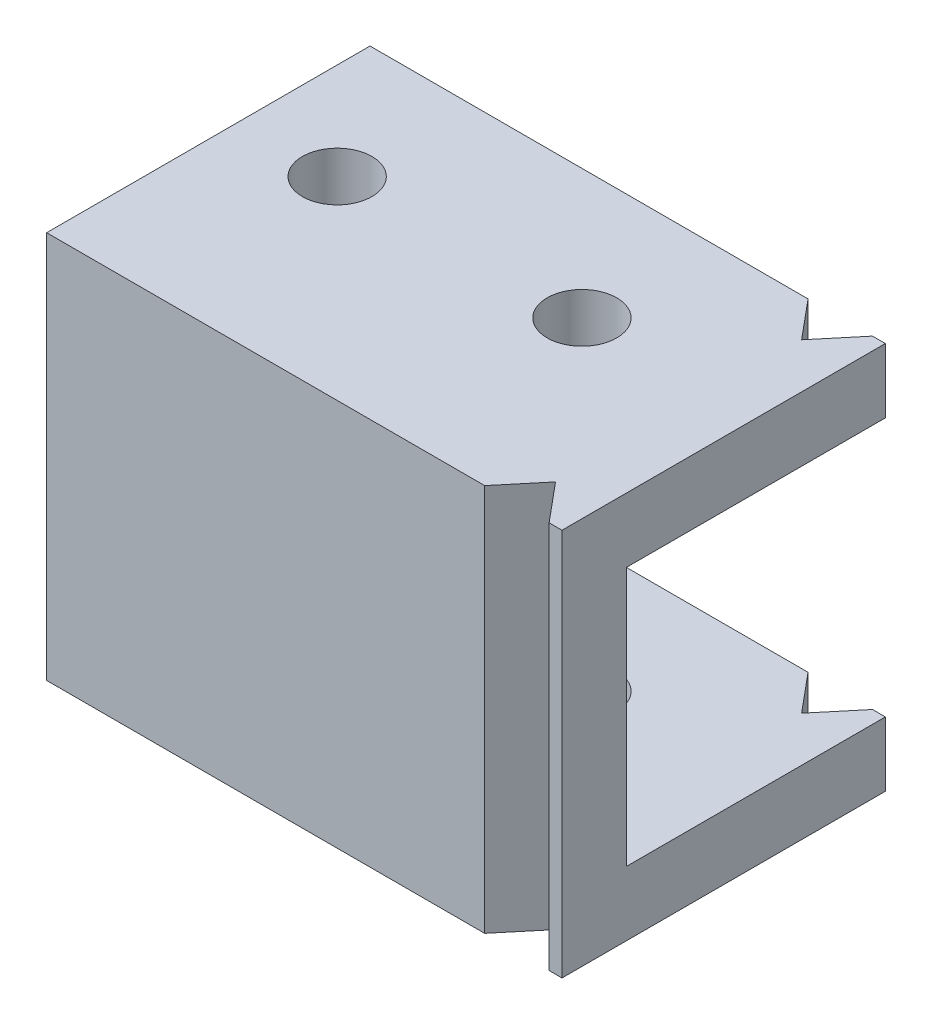
ISO-10303-21;
HEADER;
FILE_DESCRIPTION(('STEP AP214'),'2;1');
FILE_NAME('part.step','',(''),(''),'','','');
FILE_SCHEMA(('AUTOMOTIVE_DESIGN { 1 0 10303 214 1 1 1 1 }'));
ENDSEC;
DATA;
#1=APPLICATION_CONTEXT('core data for automotive mechanical design processes');
#2=APPLICATION_PROTOCOL_DEFINITION('international standard','automotive_design',2000,#1);
#3=PRODUCT_CONTEXT('',#1,'mechanical');
#4=PRODUCT('Part','Part','',(#3));
#5=PRODUCT_RELATED_PRODUCT_CATEGORY('part','',(#4));
#6=PRODUCT_DEFINITION_FORMATION('','',#4);
#7=PRODUCT_DEFINITION_CONTEXT('part definition',#1,'design');
#8=PRODUCT_DEFINITION('design','',#6,#7);
#9=PRODUCT_DEFINITION_SHAPE('','',#8);
#10=(LENGTH_UNIT() NAMED_UNIT(*) SI_UNIT(.MILLI.,.METRE.));
#11=(NAMED_UNIT(*) PLANE_ANGLE_UNIT() SI_UNIT($,.RADIAN.));
#12=(NAMED_UNIT(*) SI_UNIT($,.STERADIAN.) SOLID_ANGLE_UNIT());
#13=UNCERTAINTY_MEASURE_WITH_UNIT(LENGTH_MEASURE(1.E-05),#10,'distance_accuracy_value','');
#14=(GEOMETRIC_REPRESENTATION_CONTEXT(3) GLOBAL_UNCERTAINTY_ASSIGNED_CONTEXT((#13)) GLOBAL_UNIT_ASSIGNED_CONTEXT((#10,
#11,#12)) REPRESENTATION_CONTEXT('',''));
#15=CARTESIAN_POINT('',(0.,0.,0.));
#16=DIRECTION('',(0.,0.,1.));
#17=DIRECTION('',(1.,0.,0.));
#18=AXIS2_PLACEMENT_3D('',#15,#16,#17);
#19=CARTESIAN_POINT('',(40.,15.05,-10.05));
#20=DIRECTION('',(0.,0.,1.));
#21=DIRECTION('',(1.,0.,0.));
#22=AXIS2_PLACEMENT_3D('',#19,#20,#21);
#23=PLANE('',#22);
#24=DIRECTION('',(-1.,0.,0.));
#25=VECTOR('',#24,1.);
#26=CARTESIAN_POINT('',(40.,10.05,-10.05));
#27=LINE('',#26,#25);
#28=CARTESIAN_POINT('',(40.,10.05,-10.05));
#29=VERTEX_POINT('',#28);
#30=CARTESIAN_POINT('',(39.,10.05,-10.05));
#31=VERTEX_POINT('',#30);
#32=EDGE_CURVE('E204',#29,#31,#27,.T.);
#33=ORIENTED_EDGE('',*,*,#32,.T.);
#34=DIRECTION('',(0.,1.,0.));
#35=VECTOR('',#34,1.);
#36=CARTESIAN_POINT('',(39.,-15.05,-10.05));
#37=LINE('',#36,#35);
#38=CARTESIAN_POINT('',(39.,15.05,-10.05));
#39=VERTEX_POINT('',#38);
#40=EDGE_CURVE('E295',#31,#39,#37,.T.);
#41=ORIENTED_EDGE('',*,*,#40,.T.);
#42=DIRECTION('',(-1.,0.,0.));
#43=VECTOR('',#42,1.);
#44=CARTESIAN_POINT('',(40.,15.05,-10.05));
#45=LINE('',#44,#43);
#46=CARTESIAN_POINT('',(40.,15.05,-10.05));
#47=VERTEX_POINT('',#46);
#48=EDGE_CURVE('E200',#47,#39,#45,.T.);
#49=ORIENTED_EDGE('',*,*,#48,.F.);
#50=DIRECTION('',(0.,1.,0.));
#51=VECTOR('',#50,1.);
#52=CARTESIAN_POINT('',(40.,15.05,-10.05));
#53=LINE('',#52,#51);
#54=EDGE_CURVE('E238',#29,#47,#53,.T.);
#55=ORIENTED_EDGE('',*,*,#54,.F.);
#56=EDGE_LOOP('',(#33,#41,#49,#55));
#57=FACE_BOUND('',#56,.T.);
#58=ADVANCED_FACE('F35',(#57),#23,.F.);
#59=CARTESIAN_POINT('',(40.,-15.05,15.05));
#60=DIRECTION('',(0.,0.,-1.));
#61=DIRECTION('',(-1.,0.,0.));
#62=AXIS2_PLACEMENT_3D('',#59,#60,#61);
#63=PLANE('',#62);
#64=DIRECTION('',(-1.,0.,0.));
#65=VECTOR('',#64,1.);
#66=CARTESIAN_POINT('',(40.,-15.05,15.05));
#67=LINE('',#66,#65);
#68=CARTESIAN_POINT('',(34.,-15.05,15.05));
#69=VERTEX_POINT('',#68);
#70=CARTESIAN_POINT('',(0.,-15.05,15.05));
#71=VERTEX_POINT('',#70);
#72=EDGE_CURVE('E187',#69,#71,#67,.T.);
#73=ORIENTED_EDGE('',*,*,#72,.F.);
#74=DIRECTION('',(0.,1.,0.));
#75=VECTOR('',#74,1.);
#76=CARTESIAN_POINT('',(34.,-15.05,15.05));
#77=LINE('',#76,#75);
#78=CARTESIAN_POINT('',(34.,15.05,15.05));
#79=VERTEX_POINT('',#78);
#80=EDGE_CURVE('E315',#69,#79,#77,.T.);
#81=ORIENTED_EDGE('',*,*,#80,.T.);
#82=DIRECTION('',(-1.,0.,0.));
#83=VECTOR('',#82,1.);
#84=CARTESIAN_POINT('',(40.,15.05,15.05));
#85=LINE('',#84,#83);
#86=CARTESIAN_POINT('',(0.,15.05,15.05));
#87=VERTEX_POINT('',#86);
#88=EDGE_CURVE('E195',#79,#87,#85,.T.);
#89=ORIENTED_EDGE('',*,*,#88,.T.);
#90=DIRECTION('',(0.,-1.,0.));
#91=VECTOR('',#90,1.);
#92=CARTESIAN_POINT('',(0.,-15.05,15.05));
#93=LINE('',#92,#91);
#94=EDGE_CURVE('E262',#87,#71,#93,.T.);
#95=ORIENTED_EDGE('',*,*,#94,.T.);
#96=EDGE_LOOP('',(#73,#81,#89,#95));
#97=FACE_BOUND('',#96,.T.);
#98=ADVANCED_FACE('F373',(#97),#63,.F.);
#99=CARTESIAN_POINT('',(40.,-10.05,-10.05));
#100=DIRECTION('',(0.,0.,1.));
#101=DIRECTION('',(0.,-1.,0.));
#102=AXIS2_PLACEMENT_3D('',#99,#100,#101);
#103=PLANE('',#102);
#104=DIRECTION('',(-1.,0.,0.));
#105=VECTOR('',#104,1.);
#106=CARTESIAN_POINT('',(40.,-15.05,-10.05));
#107=LINE('',#106,#105);
#108=CARTESIAN_POINT('',(40.,-15.05,-10.05));
#109=VERTEX_POINT('',#108);
#110=CARTESIAN_POINT('',(39.,-15.05,-10.05));
#111=VERTEX_POINT('',#110);
#112=EDGE_CURVE('E183',#109,#111,#107,.T.);
#113=ORIENTED_EDGE('',*,*,#112,.T.);
#114=CARTESIAN_POINT('',(39.,-10.05,-10.05));
#115=VERTEX_POINT('',#114);
#116=EDGE_CURVE('E291',#111,#115,#37,.T.);
#117=ORIENTED_EDGE('',*,*,#116,.T.);
#118=DIRECTION('',(-1.,0.,0.));
#119=VECTOR('',#118,1.);
#120=CARTESIAN_POINT('',(40.,-10.05,-10.05));
#121=LINE('',#120,#119);
#122=CARTESIAN_POINT('',(40.,-10.05,-10.05));
#123=VERTEX_POINT('',#122);
#124=EDGE_CURVE('E184',#123,#115,#121,.T.);
#125=ORIENTED_EDGE('',*,*,#124,.F.);
#126=DIRECTION('',(0.,1.,0.));
#127=VECTOR('',#126,1.);
#128=CARTESIAN_POINT('',(40.,-10.05,-10.05));
#129=LINE('',#128,#127);
#130=EDGE_CURVE('E246',#109,#123,#129,.T.);
#131=ORIENTED_EDGE('',*,*,#130,.F.);
#132=EDGE_LOOP('',(#113,#117,#125,#131));
#133=FACE_BOUND('',#132,.T.);
#134=ADVANCED_FACE('F290',(#133),#103,.F.);
#135=CARTESIAN_POINT('',(40.,10.05,10.05));
#136=DIRECTION('',(0.,0.,1.));
#137=DIRECTION('',(0.,-1.,0.));
#138=AXIS2_PLACEMENT_3D('',#135,#136,#137);
#139=PLANE('',#138);
#140=DIRECTION('',(0.,1.,0.));
#141=VECTOR('',#140,1.);
#142=CARTESIAN_POINT('',(0.,10.05,10.05));
#143=LINE('',#142,#141);
#144=CARTESIAN_POINT('',(0.,-10.05,10.05));
#145=VERTEX_POINT('',#144);
#146=CARTESIAN_POINT('',(0.,10.05,10.05));
#147=VERTEX_POINT('',#146);
#148=EDGE_CURVE('E231',#145,#147,#143,.T.);
#149=ORIENTED_EDGE('',*,*,#148,.T.);
#150=DIRECTION('',(-1.,0.,0.));
#151=VECTOR('',#150,1.);
#152=CARTESIAN_POINT('',(40.,10.05,10.05));
#153=LINE('',#152,#151);
#154=CARTESIAN_POINT('',(40.,10.05,10.05));
#155=VERTEX_POINT('',#154);
#156=EDGE_CURVE('E207',#155,#147,#153,.T.);
#157=ORIENTED_EDGE('',*,*,#156,.F.);
#158=DIRECTION('',(0.,1.,0.));
#159=VECTOR('',#158,1.);
#160=CARTESIAN_POINT('',(40.,10.05,10.05));
#161=LINE('',#160,#159);
#162=CARTESIAN_POINT('',(40.,-10.05,10.05));
#163=VERTEX_POINT('',#162);
#164=EDGE_CURVE('E232',#163,#155,#161,.T.);
#165=ORIENTED_EDGE('',*,*,#164,.F.);
#166=DIRECTION('',(-1.,0.,0.));
#167=VECTOR('',#166,1.);
#168=CARTESIAN_POINT('',(40.,-10.05,10.05));
#169=LINE('',#168,#167);
#170=EDGE_CURVE('E250',#163,#145,#169,.T.);
#171=ORIENTED_EDGE('',*,*,#170,.T.);
#172=EDGE_LOOP('',(#149,#157,#165,#171));
#173=FACE_BOUND('',#172,.T.);
#174=ADVANCED_FACE('F37',(#173),#139,.F.);
#175=CARTESIAN_POINT('',(40.,10.05,-10.05));
#176=DIRECTION('',(0.,1.,0.));
#177=DIRECTION('',(0.,0.,1.));
#178=AXIS2_PLACEMENT_3D('',#175,#176,#177);
#179=PLANE('',#178);
#180=CARTESIAN_POINT('',(7.5,10.05,0.));
#181=DIRECTION('',(0.,1.,0.));
#182=DIRECTION('',(0.,0.,1.));
#183=AXIS2_PLACEMENT_3D('',#180,#181,#182);
#184=CIRCLE('',#183,2.7);
#185=CARTESIAN_POINT('',(7.5,10.05,2.7));
#186=VERTEX_POINT('',#185);
#187=EDGE_CURVE('E228',#186,#186,#184,.T.);
#188=ORIENTED_EDGE('',*,*,#187,.T.);
#189=EDGE_LOOP('',(#188));
#190=FACE_BOUND('',#189,.T.);
#191=CARTESIAN_POINT('',(26.5,10.05,0.));
#192=DIRECTION('',(0.,1.,0.));
#193=DIRECTION('',(0.,0.,1.));
#194=AXIS2_PLACEMENT_3D('',#191,#192,#193);
#195=CIRCLE('',#194,2.70000000000001);
#196=CARTESIAN_POINT('',(26.5,10.05,2.70000000000001));
#197=VERTEX_POINT('',#196);
#198=EDGE_CURVE('E212',#197,#197,#195,.T.);
#199=ORIENTED_EDGE('',*,*,#198,.T.);
#200=EDGE_LOOP('',(#199));
#201=FACE_BOUND('',#200,.T.);
#202=DIRECTION('',(0.64018439966448,0.,0.768221279597376));
#203=VECTOR('',#202,1.);
#204=CARTESIAN_POINT('',(36.4590163934426,10.05,-7.09918032786885));
#205=LINE('',#204,#203);
#206=CARTESIAN_POINT('',(34.,10.05,-10.05));
#207=VERTEX_POINT('',#206);
#208=CARTESIAN_POINT('',(36.5,10.05,-7.05));
#209=VERTEX_POINT('',#208);
#210=EDGE_CURVE('E219',#207,#209,#205,.T.);
#211=ORIENTED_EDGE('',*,*,#210,.T.);
#212=DIRECTION('',(0.640184399664479,0.,-0.768221279597377));
#213=VECTOR('',#212,1.);
#214=CARTESIAN_POINT('',(39.4098360655738,10.05,-10.5418032786885));
#215=LINE('',#214,#213);
#216=EDGE_CURVE('E213',#209,#31,#215,.T.);
#217=ORIENTED_EDGE('',*,*,#216,.T.);
#218=ORIENTED_EDGE('',*,*,#32,.F.);
#219=DIRECTION('',(0.,0.,-1.));
#220=VECTOR('',#219,1.);
#221=CARTESIAN_POINT('',(40.,10.05,-10.05));
#222=LINE('',#221,#220);
#223=EDGE_CURVE('E235',#155,#29,#222,.T.);
#224=ORIENTED_EDGE('',*,*,#223,.F.);
#225=ORIENTED_EDGE('',*,*,#156,.T.);
#226=DIRECTION('',(0.,0.,-1.));
#227=VECTOR('',#226,1.);
#228=CARTESIAN_POINT('',(0.,10.05,-10.05));
#229=LINE('',#228,#227);
#230=CARTESIAN_POINT('',(0.,10.05,-10.05));
#231=VERTEX_POINT('',#230);
#232=EDGE_CURVE('E253',#147,#231,#229,.T.);
#233=ORIENTED_EDGE('',*,*,#232,.T.);
#234=EDGE_CURVE('E203',#207,#231,#27,.T.);
#235=ORIENTED_EDGE('',*,*,#234,.F.);
#236=EDGE_LOOP('',(#211,#217,#218,#224,#225,#233,#235));
#237=FACE_BOUND('',#236,.T.);
#238=ADVANCED_FACE('F280',(#190,#201,#237),#179,.F.);
#239=CARTESIAN_POINT('',(34.,15.05,-10.05));
#240=VERTEX_POINT('',#239);
#241=CARTESIAN_POINT('',(0.,15.05,-10.05));
#242=VERTEX_POINT('',#241);
#243=EDGE_CURVE('E199',#240,#242,#45,.T.);
#244=ORIENTED_EDGE('',*,*,#243,.F.);
#245=DIRECTION('',(0.,1.,0.));
#246=VECTOR('',#245,1.);
#247=CARTESIAN_POINT('',(34.,-15.05,-10.05));
#248=LINE('',#247,#246);
#249=EDGE_CURVE('E52',#207,#240,#248,.T.);
#250=ORIENTED_EDGE('',*,*,#249,.F.);
#251=ORIENTED_EDGE('',*,*,#234,.T.);
#252=DIRECTION('',(0.,1.,0.));
#253=VECTOR('',#252,1.);
#254=CARTESIAN_POINT('',(0.,15.05,-10.05));
#255=LINE('',#254,#253);
#256=EDGE_CURVE('E256',#231,#242,#255,.T.);
#257=ORIENTED_EDGE('',*,*,#256,.T.);
#258=EDGE_LOOP('',(#244,#250,#251,#257));
#259=FACE_BOUND('',#258,.T.);
#260=ADVANCED_FACE('F375',(#259),#23,.F.);
#261=CARTESIAN_POINT('',(40.,15.05,15.05));
#262=DIRECTION('',(0.,-1.,0.));
#263=DIRECTION('',(0.,0.,-1.));
#264=AXIS2_PLACEMENT_3D('',#261,#262,#263);
#265=PLANE('',#264);
#266=CARTESIAN_POINT('',(7.5,15.05,0.));
#267=DIRECTION('',(0.,1.,0.));
#268=DIRECTION('',(0.,0.,1.));
#269=AXIS2_PLACEMENT_3D('',#266,#267,#268);
#270=CIRCLE('',#269,2.7);
#271=CARTESIAN_POINT('',(7.5,15.05,2.7));
#272=VERTEX_POINT('',#271);
#273=EDGE_CURVE('E345',#272,#272,#270,.T.);
#274=ORIENTED_EDGE('',*,*,#273,.F.);
#275=EDGE_LOOP('',(#274));
#276=FACE_BOUND('',#275,.T.);
#277=CARTESIAN_POINT('',(26.5,15.05,0.));
#278=DIRECTION('',(0.,1.,0.));
#279=DIRECTION('',(0.,0.,1.));
#280=AXIS2_PLACEMENT_3D('',#277,#278,#279);
#281=CIRCLE('',#280,2.70000000000001);
#282=CARTESIAN_POINT('',(26.5,15.05,2.70000000000001));
#283=VERTEX_POINT('',#282);
#284=EDGE_CURVE('E294',#283,#283,#281,.T.);
#285=ORIENTED_EDGE('',*,*,#284,.F.);
#286=EDGE_LOOP('',(#285));
#287=FACE_BOUND('',#286,.T.);
#288=ORIENTED_EDGE('',*,*,#48,.T.);
#289=DIRECTION('',(0.640184399664479,0.,-0.768221279597377));
#290=VECTOR('',#289,1.);
#291=CARTESIAN_POINT('',(36.5,15.05,-7.05));
#292=LINE('',#291,#290);
#293=CARTESIAN_POINT('',(36.5,15.05,-7.05));
#294=VERTEX_POINT('',#293);
#295=EDGE_CURVE('E168',#294,#39,#292,.T.);
#296=ORIENTED_EDGE('',*,*,#295,.F.);
#297=DIRECTION('',(0.64018439966448,0.,0.768221279597375));
#298=VECTOR('',#297,1.);
#299=CARTESIAN_POINT('',(34.,15.05,-10.05));
#300=LINE('',#299,#298);
#301=EDGE_CURVE('E318',#240,#294,#300,.T.);
#302=ORIENTED_EDGE('',*,*,#301,.F.);
#303=ORIENTED_EDGE('',*,*,#243,.T.);
#304=DIRECTION('',(0.,0.,1.));
#305=VECTOR('',#304,1.);
#306=CARTESIAN_POINT('',(0.,15.05,15.05));
#307=LINE('',#306,#305);
#308=EDGE_CURVE('E259',#242,#87,#307,.T.);
#309=ORIENTED_EDGE('',*,*,#308,.T.);
#310=ORIENTED_EDGE('',*,*,#88,.F.);
#311=DIRECTION('',(-0.64018439966448,0.,0.768221279597375));
#312=VECTOR('',#311,1.);
#313=CARTESIAN_POINT('',(34.,15.05,15.05));
#314=LINE('',#313,#312);
#315=CARTESIAN_POINT('',(36.5,15.05,12.05));
#316=VERTEX_POINT('',#315);
#317=EDGE_CURVE('E308',#316,#79,#314,.T.);
#318=ORIENTED_EDGE('',*,*,#317,.F.);
#319=DIRECTION('',(-0.640184399664479,0.,-0.768221279597377));
#320=VECTOR('',#319,1.);
#321=CARTESIAN_POINT('',(36.5,15.05,12.05));
#322=LINE('',#321,#320);
#323=CARTESIAN_POINT('',(39.,15.05,15.05));
#324=VERTEX_POINT('',#323);
#325=EDGE_CURVE('E311',#324,#316,#322,.T.);
#326=ORIENTED_EDGE('',*,*,#325,.F.);
#327=CARTESIAN_POINT('',(40.,15.05,15.05));
#328=VERTEX_POINT('',#327);
#329=EDGE_CURVE('E196',#328,#324,#85,.T.);
#330=ORIENTED_EDGE('',*,*,#329,.F.);
#331=DIRECTION('',(0.,0.,1.));
#332=VECTOR('',#331,1.);
#333=CARTESIAN_POINT('',(40.,15.05,15.05));
#334=LINE('',#333,#332);
#335=EDGE_CURVE('E240',#47,#328,#334,.T.);
#336=ORIENTED_EDGE('',*,*,#335,.F.);
#337=EDGE_LOOP('',(#288,#296,#302,#303,#309,#310,#318,#326,#330,#336));
#338=FACE_BOUND('',#337,.T.);
#339=ADVANCED_FACE('F329',(#276,#287,#338),#265,.F.);
#340=ORIENTED_EDGE('',*,*,#329,.T.);
#341=DIRECTION('',(0.,1.,0.));
#342=VECTOR('',#341,1.);
#343=CARTESIAN_POINT('',(39.,-15.05,15.05));
#344=LINE('',#343,#342);
#345=CARTESIAN_POINT('',(39.,-15.05,15.05));
#346=VERTEX_POINT('',#345);
#347=EDGE_CURVE('E310',#346,#324,#344,.T.);
#348=ORIENTED_EDGE('',*,*,#347,.F.);
#349=CARTESIAN_POINT('',(40.,-15.05,15.05));
#350=VERTEX_POINT('',#349);
#351=EDGE_CURVE('E192',#350,#346,#67,.T.);
#352=ORIENTED_EDGE('',*,*,#351,.F.);
#353=DIRECTION('',(0.,-1.,0.));
#354=VECTOR('',#353,1.);
#355=CARTESIAN_POINT('',(40.,-15.05,15.05));
#356=LINE('',#355,#354);
#357=EDGE_CURVE('E242',#328,#350,#356,.T.);
#358=ORIENTED_EDGE('',*,*,#357,.F.);
#359=EDGE_LOOP('',(#340,#348,#352,#358));
#360=FACE_BOUND('',#359,.T.);
#361=ADVANCED_FACE('F333',(#360),#63,.F.);
#362=CARTESIAN_POINT('',(40.,-15.05,-10.05));
#363=DIRECTION('',(0.,1.,0.));
#364=DIRECTION('',(0.,0.,1.));
#365=AXIS2_PLACEMENT_3D('',#362,#363,#364);
#366=PLANE('',#365);
#367=CARTESIAN_POINT('',(7.5,-15.05,0.));
#368=DIRECTION('',(0.,1.,0.));
#369=DIRECTION('',(0.,0.,1.));
#370=AXIS2_PLACEMENT_3D('',#367,#368,#369);
#371=CIRCLE('',#370,2.7);
#372=CARTESIAN_POINT('',(7.5,-15.05,2.7));
#373=VERTEX_POINT('',#372);
#374=EDGE_CURVE('E224',#373,#373,#371,.T.);
#375=ORIENTED_EDGE('',*,*,#374,.T.);
#376=EDGE_LOOP('',(#375));
#377=FACE_BOUND('',#376,.T.);
#378=CARTESIAN_POINT('',(26.5,-15.05,0.));
#379=DIRECTION('',(0.,1.,0.));
#380=DIRECTION('',(0.,0.,1.));
#381=AXIS2_PLACEMENT_3D('',#378,#379,#380);
#382=CIRCLE('',#381,2.70000000000001);
#383=CARTESIAN_POINT('',(26.5,-15.05,2.70000000000001));
#384=VERTEX_POINT('',#383);
#385=EDGE_CURVE('E298',#384,#384,#382,.T.);
#386=ORIENTED_EDGE('',*,*,#385,.T.);
#387=EDGE_LOOP('',(#386));
#388=FACE_BOUND('',#387,.T.);
#389=DIRECTION('',(0.64018439966448,0.,0.768221279597375));
#390=VECTOR('',#389,1.);
#391=CARTESIAN_POINT('',(34.,-15.05,-10.05));
#392=LINE('',#391,#390);
#393=CARTESIAN_POINT('',(34.,-15.05,-10.05));
#394=VERTEX_POINT('',#393);
#395=CARTESIAN_POINT('',(36.5,-15.05,-7.05));
#396=VERTEX_POINT('',#395);
#397=EDGE_CURVE('E156',#394,#396,#392,.T.);
#398=ORIENTED_EDGE('',*,*,#397,.T.);
#399=DIRECTION('',(0.640184399664479,0.,-0.768221279597377));
#400=VECTOR('',#399,1.);
#401=CARTESIAN_POINT('',(36.5,-15.05,-7.05));
#402=LINE('',#401,#400);
#403=EDGE_CURVE('E167',#396,#111,#402,.T.);
#404=ORIENTED_EDGE('',*,*,#403,.T.);
#405=ORIENTED_EDGE('',*,*,#112,.F.);
#406=DIRECTION('',(0.,0.,-1.));
#407=VECTOR('',#406,1.);
#408=CARTESIAN_POINT('',(40.,-15.05,-10.05));
#409=LINE('',#408,#407);
#410=EDGE_CURVE('E244',#350,#109,#409,.T.);
#411=ORIENTED_EDGE('',*,*,#410,.F.);
#412=ORIENTED_EDGE('',*,*,#351,.T.);
#413=DIRECTION('',(-0.640184399664479,0.,-0.768221279597377));
#414=VECTOR('',#413,1.);
#415=CARTESIAN_POINT('',(36.5,-15.05,12.05));
#416=LINE('',#415,#414);
#417=CARTESIAN_POINT('',(36.5,-15.05,12.05));
#418=VERTEX_POINT('',#417);
#419=EDGE_CURVE('E305',#346,#418,#416,.T.);
#420=ORIENTED_EDGE('',*,*,#419,.T.);
#421=DIRECTION('',(-0.64018439966448,0.,0.768221279597375));
#422=VECTOR('',#421,1.);
#423=CARTESIAN_POINT('',(34.,-15.05,15.05));
#424=LINE('',#423,#422);
#425=EDGE_CURVE('E60',#418,#69,#424,.T.);
#426=ORIENTED_EDGE('',*,*,#425,.T.);
#427=ORIENTED_EDGE('',*,*,#72,.T.);
#428=DIRECTION('',(0.,0.,-1.));
#429=VECTOR('',#428,1.);
#430=CARTESIAN_POINT('',(0.,-15.05,-10.05));
#431=LINE('',#430,#429);
#432=CARTESIAN_POINT('',(0.,-15.05,-10.05));
#433=VERTEX_POINT('',#432);
#434=EDGE_CURVE('E181',#71,#433,#431,.T.);
#435=ORIENTED_EDGE('',*,*,#434,.T.);
#436=EDGE_CURVE('E174',#394,#433,#107,.T.);
#437=ORIENTED_EDGE('',*,*,#436,.F.);
#438=EDGE_LOOP('',(#398,#404,#405,#411,#412,#420,#426,#427,#435,#437));
#439=FACE_BOUND('',#438,.T.);
#440=ADVANCED_FACE('F179',(#377,#388,#439),#366,.F.);
#441=CARTESIAN_POINT('',(34.,-10.05,-10.05));
#442=VERTEX_POINT('',#441);
#443=CARTESIAN_POINT('',(0.,-10.05,-10.05));
#444=VERTEX_POINT('',#443);
#445=EDGE_CURVE('E176',#442,#444,#121,.T.);
#446=ORIENTED_EDGE('',*,*,#445,.F.);
#447=EDGE_CURVE('E159',#394,#442,#248,.T.);
#448=ORIENTED_EDGE('',*,*,#447,.F.);
#449=ORIENTED_EDGE('',*,*,#436,.T.);
#450=DIRECTION('',(0.,1.,0.));
#451=VECTOR('',#450,1.);
#452=CARTESIAN_POINT('',(0.,-10.05,-10.05));
#453=LINE('',#452,#451);
#454=EDGE_CURVE('E266',#433,#444,#453,.T.);
#455=ORIENTED_EDGE('',*,*,#454,.T.);
#456=EDGE_LOOP('',(#446,#448,#449,#455));
#457=FACE_BOUND('',#456,.T.);
#458=ADVANCED_FACE('F172',(#457),#103,.F.);
#459=CARTESIAN_POINT('',(40.,-10.05,10.05));
#460=DIRECTION('',(0.,-1.,0.));
#461=DIRECTION('',(0.,0.,-1.));
#462=AXIS2_PLACEMENT_3D('',#459,#460,#461);
#463=PLANE('',#462);
#464=CARTESIAN_POINT('',(7.5,-10.05,0.));
#465=DIRECTION('',(0.,-1.,0.));
#466=DIRECTION('',(0.,0.,-1.));
#467=AXIS2_PLACEMENT_3D('',#464,#465,#466);
#468=CIRCLE('',#467,2.7);
#469=CARTESIAN_POINT('',(7.5,-10.05,-2.7));
#470=VERTEX_POINT('',#469);
#471=EDGE_CURVE('E39',#470,#470,#468,.T.);
#472=ORIENTED_EDGE('',*,*,#471,.T.);
#473=EDGE_LOOP('',(#472));
#474=FACE_BOUND('',#473,.T.);
#475=CARTESIAN_POINT('',(26.5,-10.05,0.));
#476=DIRECTION('',(0.,-1.,0.));
#477=DIRECTION('',(0.,0.,-1.));
#478=AXIS2_PLACEMENT_3D('',#475,#476,#477);
#479=CIRCLE('',#478,2.70000000000001);
#480=CARTESIAN_POINT('',(26.5,-10.05,-2.70000000000001));
#481=VERTEX_POINT('',#480);
#482=EDGE_CURVE('E210',#481,#481,#479,.T.);
#483=ORIENTED_EDGE('',*,*,#482,.T.);
#484=EDGE_LOOP('',(#483));
#485=FACE_BOUND('',#484,.T.);
#486=ORIENTED_EDGE('',*,*,#124,.T.);
#487=DIRECTION('',(-0.640184399664479,0.,0.768221279597377));
#488=VECTOR('',#487,1.);
#489=CARTESIAN_POINT('',(29.5245901639344,-10.05,1.3204918032787));
#490=LINE('',#489,#488);
#491=CARTESIAN_POINT('',(36.5,-10.05,-7.05));
#492=VERTEX_POINT('',#491);
#493=EDGE_CURVE('E11',#115,#492,#490,.T.);
#494=ORIENTED_EDGE('',*,*,#493,.T.);
#495=DIRECTION('',(-0.64018439966448,0.,-0.768221279597376));
#496=VECTOR('',#495,1.);
#497=CARTESIAN_POINT('',(46.344262295082,-10.05,4.76311475409835));
#498=LINE('',#497,#496);
#499=EDGE_CURVE('E44',#492,#442,#498,.T.);
#500=ORIENTED_EDGE('',*,*,#499,.T.);
#501=ORIENTED_EDGE('',*,*,#445,.T.);
#502=DIRECTION('',(0.,0.,1.));
#503=VECTOR('',#502,1.);
#504=CARTESIAN_POINT('',(0.,-10.05,10.05));
#505=LINE('',#504,#503);
#506=EDGE_CURVE('E236',#444,#145,#505,.T.);
#507=ORIENTED_EDGE('',*,*,#506,.T.);
#508=ORIENTED_EDGE('',*,*,#170,.F.);
#509=DIRECTION('',(0.,0.,1.));
#510=VECTOR('',#509,1.);
#511=CARTESIAN_POINT('',(40.,-10.05,10.05));
#512=LINE('',#511,#510);
#513=EDGE_CURVE('E248',#123,#163,#512,.T.);
#514=ORIENTED_EDGE('',*,*,#513,.F.);
#515=EDGE_LOOP('',(#486,#494,#500,#501,#507,#508,#514));
#516=FACE_BOUND('',#515,.T.);
#517=ADVANCED_FACE('F274',(#474,#485,#516),#463,.F.);
#518=CARTESIAN_POINT('',(40.,0.,0.));
#519=DIRECTION('',(1.,0.,0.));
#520=DIRECTION('',(0.,0.,-1.));
#521=AXIS2_PLACEMENT_3D('',#518,#519,#520);
#522=PLANE('',#521);
#523=ORIENTED_EDGE('',*,*,#164,.T.);
#524=ORIENTED_EDGE('',*,*,#223,.T.);
#525=ORIENTED_EDGE('',*,*,#54,.T.);
#526=ORIENTED_EDGE('',*,*,#335,.T.);
#527=ORIENTED_EDGE('',*,*,#357,.T.);
#528=ORIENTED_EDGE('',*,*,#410,.T.);
#529=ORIENTED_EDGE('',*,*,#130,.T.);
#530=ORIENTED_EDGE('',*,*,#513,.T.);
#531=EDGE_LOOP('',(#523,#524,#525,#526,#527,#528,#529,#530));
#532=FACE_BOUND('',#531,.T.);
#533=ADVANCED_FACE('F284',(#532),#522,.T.);
#534=CARTESIAN_POINT('',(0.,0.,0.));
#535=DIRECTION('',(1.,0.,0.));
#536=DIRECTION('',(0.,0.,-1.));
#537=AXIS2_PLACEMENT_3D('',#534,#535,#536);
#538=PLANE('',#537);
#539=ORIENTED_EDGE('',*,*,#148,.F.);
#540=ORIENTED_EDGE('',*,*,#506,.F.);
#541=ORIENTED_EDGE('',*,*,#454,.F.);
#542=ORIENTED_EDGE('',*,*,#434,.F.);
#543=ORIENTED_EDGE('',*,*,#94,.F.);
#544=ORIENTED_EDGE('',*,*,#308,.F.);
#545=ORIENTED_EDGE('',*,*,#256,.F.);
#546=ORIENTED_EDGE('',*,*,#232,.F.);
#547=EDGE_LOOP('',(#539,#540,#541,#542,#543,#544,#545,#546));
#548=FACE_BOUND('',#547,.T.);
#549=ADVANCED_FACE('F277',(#548),#538,.F.);
#550=CARTESIAN_POINT('',(34.,-15.05,-10.05));
#551=DIRECTION('',(-0.768221279597376,0.,0.64018439966448));
#552=DIRECTION('',(0.64018439966448,0.,0.768221279597376));
#553=AXIS2_PLACEMENT_3D('',#550,#551,#552);
#554=PLANE('',#553);
#555=DIRECTION('',(0.,1.,0.));
#556=VECTOR('',#555,1.);
#557=CARTESIAN_POINT('',(36.5,-15.05,-7.05));
#558=LINE('',#557,#556);
#559=EDGE_CURVE('E162',#396,#492,#558,.T.);
#560=ORIENTED_EDGE('',*,*,#559,.F.);
#561=ORIENTED_EDGE('',*,*,#397,.F.);
#562=ORIENTED_EDGE('',*,*,#447,.T.);
#563=ORIENTED_EDGE('',*,*,#499,.F.);
#564=EDGE_LOOP('',(#560,#561,#562,#563));
#565=FACE_BOUND('',#564,.T.);
#566=ADVANCED_FACE('F158',(#565),#554,.F.);
#567=CARTESIAN_POINT('',(36.5,-15.05,-7.05));
#568=DIRECTION('',(0.768221279597376,0.,0.640184399664479));
#569=DIRECTION('',(0.640184399664479,0.,-0.768221279597377));
#570=AXIS2_PLACEMENT_3D('',#567,#568,#569);
#571=PLANE('',#570);
#572=ORIENTED_EDGE('',*,*,#116,.F.);
#573=ORIENTED_EDGE('',*,*,#403,.F.);
#574=ORIENTED_EDGE('',*,*,#559,.T.);
#575=ORIENTED_EDGE('',*,*,#493,.F.);
#576=EDGE_LOOP('',(#572,#573,#574,#575));
#577=FACE_BOUND('',#576,.T.);
#578=ADVANCED_FACE('F394',(#577),#571,.F.);
#579=CARTESIAN_POINT('',(26.5,-15.05,0.));
#580=DIRECTION('',(0.,1.,0.));
#581=DIRECTION('',(0.,0.,1.));
#582=AXIS2_PLACEMENT_3D('',#579,#580,#581);
#583=CYLINDRICAL_SURFACE('',#582,2.70000000000001);
#584=ORIENTED_EDGE('',*,*,#385,.F.);
#585=EDGE_LOOP('',(#584));
#586=FACE_BOUND('',#585,.T.);
#587=ORIENTED_EDGE('',*,*,#482,.F.);
#588=EDGE_LOOP('',(#587));
#589=FACE_BOUND('',#588,.T.);
#590=ADVANCED_FACE('F357',(#586,#589),#583,.F.);
#591=CARTESIAN_POINT('',(7.5,-15.05,0.));
#592=DIRECTION('',(0.,1.,0.));
#593=DIRECTION('',(0.,0.,1.));
#594=AXIS2_PLACEMENT_3D('',#591,#592,#593);
#595=CYLINDRICAL_SURFACE('',#594,2.7);
#596=ORIENTED_EDGE('',*,*,#374,.F.);
#597=EDGE_LOOP('',(#596));
#598=FACE_BOUND('',#597,.T.);
#599=ORIENTED_EDGE('',*,*,#471,.F.);
#600=EDGE_LOOP('',(#599));
#601=FACE_BOUND('',#600,.T.);
#602=ADVANCED_FACE('F353',(#598,#601),#595,.F.);
#603=CARTESIAN_POINT('',(34.,-15.05,15.05));
#604=DIRECTION('',(-0.768221279597376,0.,-0.64018439966448));
#605=DIRECTION('',(-0.64018439966448,0.,0.768221279597376));
#606=AXIS2_PLACEMENT_3D('',#603,#604,#605);
#607=PLANE('',#606);
#608=ORIENTED_EDGE('',*,*,#317,.T.);
#609=ORIENTED_EDGE('',*,*,#80,.F.);
#610=ORIENTED_EDGE('',*,*,#425,.F.);
#611=DIRECTION('',(0.,1.,0.));
#612=VECTOR('',#611,1.);
#613=CARTESIAN_POINT('',(36.5,-15.05,12.05));
#614=LINE('',#613,#612);
#615=EDGE_CURVE('E319',#418,#316,#614,.T.);
#616=ORIENTED_EDGE('',*,*,#615,.T.);
#617=EDGE_LOOP('',(#608,#609,#610,#616));
#618=FACE_BOUND('',#617,.T.);
#619=ADVANCED_FACE('F356',(#618),#607,.F.);
#620=CARTESIAN_POINT('',(36.5,-15.05,12.05));
#621=DIRECTION('',(0.768221279597376,0.,-0.640184399664479));
#622=DIRECTION('',(-0.640184399664479,0.,-0.768221279597377));
#623=AXIS2_PLACEMENT_3D('',#620,#621,#622);
#624=PLANE('',#623);
#625=ORIENTED_EDGE('',*,*,#325,.T.);
#626=ORIENTED_EDGE('',*,*,#615,.F.);
#627=ORIENTED_EDGE('',*,*,#419,.F.);
#628=ORIENTED_EDGE('',*,*,#347,.T.);
#629=EDGE_LOOP('',(#625,#626,#627,#628));
#630=FACE_BOUND('',#629,.T.);
#631=ADVANCED_FACE('F323',(#630),#624,.F.);
#632=EDGE_CURVE('E177',#209,#294,#558,.T.);
#633=ORIENTED_EDGE('',*,*,#632,.T.);
#634=ORIENTED_EDGE('',*,*,#295,.T.);
#635=ORIENTED_EDGE('',*,*,#40,.F.);
#636=ORIENTED_EDGE('',*,*,#216,.F.);
#637=EDGE_LOOP('',(#633,#634,#635,#636));
#638=FACE_BOUND('',#637,.T.);
#639=ADVANCED_FACE('F339',(#638),#571,.F.);
#640=ORIENTED_EDGE('',*,*,#249,.T.);
#641=ORIENTED_EDGE('',*,*,#301,.T.);
#642=ORIENTED_EDGE('',*,*,#632,.F.);
#643=ORIENTED_EDGE('',*,*,#210,.F.);
#644=EDGE_LOOP('',(#640,#641,#642,#643));
#645=FACE_BOUND('',#644,.T.);
#646=ADVANCED_FACE('F405',(#645),#554,.F.);
#647=ORIENTED_EDGE('',*,*,#284,.T.);
#648=EDGE_LOOP('',(#647));
#649=FACE_BOUND('',#648,.T.);
#650=ORIENTED_EDGE('',*,*,#198,.F.);
#651=EDGE_LOOP('',(#650));
#652=FACE_BOUND('',#651,.T.);
#653=ADVANCED_FACE('F403',(#649,#652),#583,.F.);
#654=ORIENTED_EDGE('',*,*,#273,.T.);
#655=EDGE_LOOP('',(#654));
#656=FACE_BOUND('',#655,.T.);
#657=ORIENTED_EDGE('',*,*,#187,.F.);
#658=EDGE_LOOP('',(#657));
#659=FACE_BOUND('',#658,.T.);
#660=ADVANCED_FACE('F359',(#656,#659),#595,.F.);
#661=CLOSED_SHELL('',(#58,#98,#134,#174,#238,#260,#339,#361,#440,#458,#517,#533,#549,#566,#578,
#590,#602,#619,#631,#639,#646,#653,#660));
#662=MANIFOLD_SOLID_BREP('B2',#661);
#663=ADVANCED_BREP_SHAPE_REPRESENTATION('',(#18,#662),#14);
#664=SHAPE_DEFINITION_REPRESENTATION(#9,#663);
ENDSEC;
END-ISO-10303-21;
